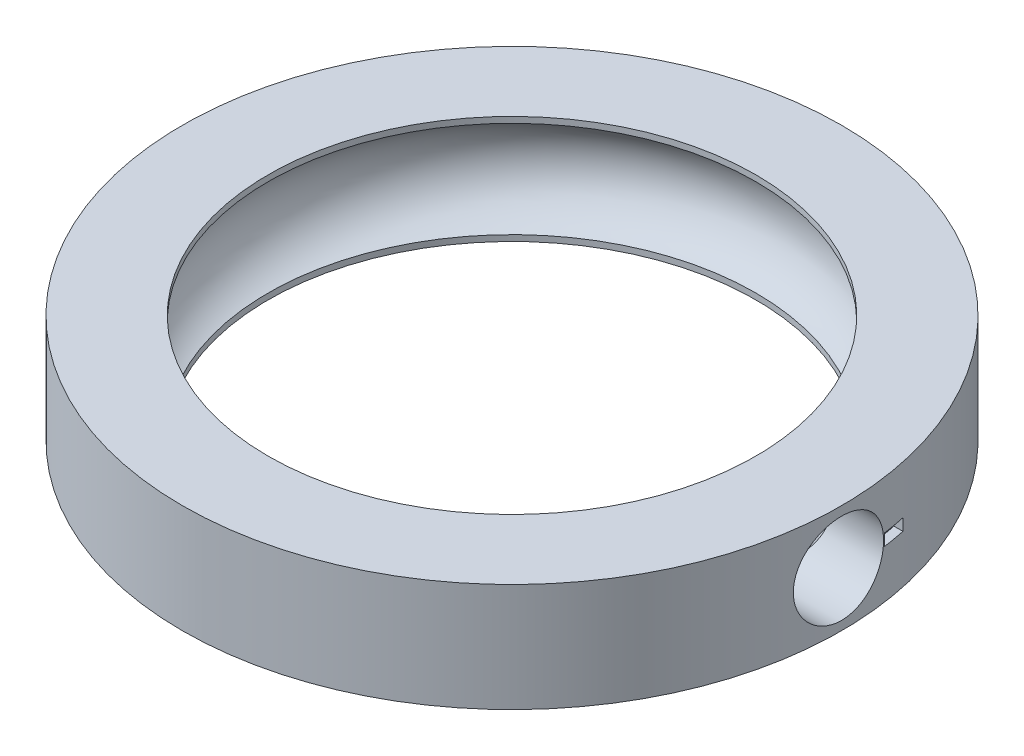
ISO-10303-21;
HEADER;
FILE_DESCRIPTION(('STEP AP214'),'2;1');
FILE_NAME('part.step','',(''),(''),'','','');
FILE_SCHEMA(('AUTOMOTIVE_DESIGN { 1 0 10303 214 1 1 1 1 }'));
ENDSEC;
DATA;
#1=APPLICATION_CONTEXT('core data for automotive mechanical design processes');
#2=APPLICATION_PROTOCOL_DEFINITION('international standard','automotive_design',2000,#1);
#3=PRODUCT_CONTEXT('',#1,'mechanical');
#4=PRODUCT('Part','Part','',(#3));
#5=PRODUCT_RELATED_PRODUCT_CATEGORY('part','',(#4));
#6=PRODUCT_DEFINITION_FORMATION('','',#4);
#7=PRODUCT_DEFINITION_CONTEXT('part definition',#1,'design');
#8=PRODUCT_DEFINITION('design','',#6,#7);
#9=PRODUCT_DEFINITION_SHAPE('','',#8);
#10=(LENGTH_UNIT() NAMED_UNIT(*) SI_UNIT(.MILLI.,.METRE.));
#11=(NAMED_UNIT(*) PLANE_ANGLE_UNIT() SI_UNIT($,.RADIAN.));
#12=(NAMED_UNIT(*) SI_UNIT($,.STERADIAN.) SOLID_ANGLE_UNIT());
#13=UNCERTAINTY_MEASURE_WITH_UNIT(LENGTH_MEASURE(1.E-05),#10,'distance_accuracy_value','');
#14=(GEOMETRIC_REPRESENTATION_CONTEXT(3) GLOBAL_UNCERTAINTY_ASSIGNED_CONTEXT((#13)) GLOBAL_UNIT_ASSIGNED_CONTEXT((#10,
#11,#12)) REPRESENTATION_CONTEXT('',''));
#15=CARTESIAN_POINT('',(0.,0.,0.));
#16=DIRECTION('',(0.,0.,1.));
#17=DIRECTION('',(1.,0.,0.));
#18=AXIS2_PLACEMENT_3D('',#15,#16,#17);
#19=CARTESIAN_POINT('',(0.,6.,0.));
#20=DIRECTION('',(0.,-1.,0.));
#21=DIRECTION('',(0.,0.,-1.));
#22=AXIS2_PLACEMENT_3D('',#19,#20,#21);
#23=CYLINDRICAL_SURFACE('',#22,18.25);
#24=CARTESIAN_POINT('',(18.25,0.499999999999999,0.));
#25=CARTESIAN_POINT('',(18.2499979040116,0.500005861245504,-0.139724369501618));
#26=CARTESIAN_POINT('',(18.2483784906353,0.511753259206182,-0.279533206564035));
#27=CARTESIAN_POINT('',(18.2420741366363,0.558425963353944,-0.555252491505958));
#28=CARTESIAN_POINT('',(18.2373860938597,0.593374724887227,-0.69115884898439));
#29=CARTESIAN_POINT('',(18.2254720195933,0.685394310822123,-0.95504229326292));
#30=CARTESIAN_POINT('',(18.2182477932557,0.742449403824003,-1.08302494381824));
#31=CARTESIAN_POINT('',(18.202062445911,0.877025750622886,-1.32757707156655));
#32=CARTESIAN_POINT('',(18.1931015968321,0.954543800926233,-1.44414833131024));
#33=CARTESIAN_POINT('',(18.1743758918273,1.12838855913507,-1.66335577304885));
#34=CARTESIAN_POINT('',(18.164606629599,1.22482288873818,-1.76590623699541));
#35=CARTESIAN_POINT('',(18.1454002015019,1.43353140071663,-1.95342218965998));
#36=CARTESIAN_POINT('',(18.1359630535417,1.54580643563522,-2.03838673129997));
#37=CARTESIAN_POINT('',(18.1184463556851,1.78357534865549,-2.18864516568642));
#38=CARTESIAN_POINT('',(18.1103724937461,1.90912122087476,-2.25385750333834));
#39=CARTESIAN_POINT('',(18.0965557008651,2.16951226928633,-2.36223941235566));
#40=CARTESIAN_POINT('',(18.090812664016,2.30435702263428,-2.40540998526832));
#41=CARTESIAN_POINT('',(18.0823505059671,2.57862256729802,-2.46821968742486));
#42=CARTESIAN_POINT('',(18.079612665332,2.71800939700837,-2.48800454685787));
#43=CARTESIAN_POINT('',(18.0774138405005,2.99814962997799,-2.50393238205174));
#44=CARTESIAN_POINT('',(18.0779526988637,3.13890296725423,-2.50007649371428));
#45=CARTESIAN_POINT('',(18.082229259379,3.41675883712277,-2.46895166738218));
#46=CARTESIAN_POINT('',(18.085944918217,3.55387982999411,-2.4418440651346));
#47=CARTESIAN_POINT('',(18.096122018592,3.82160837034374,-2.36523739982944));
#48=CARTESIAN_POINT('',(18.1025835259105,3.95221576169377,-2.3157378003313));
#49=CARTESIAN_POINT('',(18.1175489811576,4.20370611281216,-2.19558141778014));
#50=CARTESIAN_POINT('',(18.1260596004328,4.324555550862,-2.12485533779655));
#51=CARTESIAN_POINT('',(18.1441593559929,4.55273191042993,-1.96430311662161));
#52=CARTESIAN_POINT('',(18.1537485514315,4.66005808959088,-1.87447592760474));
#53=CARTESIAN_POINT('',(18.1730227308133,4.85907714911466,-1.67738112139687));
#54=CARTESIAN_POINT('',(18.1827078478558,4.95063251087264,-1.56997459942147));
#55=CARTESIAN_POINT('',(18.2010082125304,5.11443751989617,-1.34124604576295));
#56=CARTESIAN_POINT('',(18.2096234567742,5.18668710602171,-1.21992397001201));
#57=CARTESIAN_POINT('',(18.2248203085879,5.30983293817849,-0.966696137526372));
#58=CARTESIAN_POINT('',(18.2314010087724,5.3607196602059,-0.834785691429525));
#59=CARTESIAN_POINT('',(18.2417794124589,5.43958137570936,-0.564181772410236));
#60=CARTESIAN_POINT('',(18.2455772726284,5.46755765900203,-0.425488681804442));
#61=CARTESIAN_POINT('',(18.2499415443552,5.49962400471943,-0.146444513006579));
#62=CARTESIAN_POINT('',(18.2505335596003,5.50390333066426,-0.00611556915733932));
#63=CARTESIAN_POINT('',(18.2484888260768,5.48895508012057,0.273257647269836));
#64=CARTESIAN_POINT('',(18.2458521602546,5.46972810752048,0.412301952758304));
#65=CARTESIAN_POINT('',(18.2376622007997,5.40847035443507,0.684593694797279));
#66=CARTESIAN_POINT('',(18.2321205673131,5.36653071739046,0.817862016654266));
#67=CARTESIAN_POINT('',(18.2187405521202,5.26113352531695,1.07547462983269));
#68=CARTESIAN_POINT('',(18.2109020784471,5.19767510864762,1.1998185635682));
#69=CARTESIAN_POINT('',(18.1937371565602,5.05059016038336,1.43689206404122));
#70=CARTESIAN_POINT('',(18.184401874396,4.96684228234124,1.54954569416385));
#71=CARTESIAN_POINT('',(18.1653129124748,4.78172612117652,1.75926601464015));
#72=CARTESIAN_POINT('',(18.1555592126372,4.68035699165745,1.85633195584381));
#73=CARTESIAN_POINT('',(18.1366527064345,4.46203798783335,2.03280094185795));
#74=CARTESIAN_POINT('',(18.1275044959868,4.34498571461474,2.11207786919162));
#75=CARTESIAN_POINT('',(18.1109230526373,4.09911558779693,2.24984473713914));
#76=CARTESIAN_POINT('',(18.1034897796954,3.97029800898892,2.30833516308778));
#77=CARTESIAN_POINT('',(18.0912121062168,3.70494671325027,2.40266847878071));
#78=CARTESIAN_POINT('',(18.0863598328567,3.56843788237555,2.43858030175146));
#79=CARTESIAN_POINT('',(18.0797717497483,3.29125602132422,2.48695788125156));
#80=CARTESIAN_POINT('',(18.078035763259,3.1505832277678,2.49942496745691));
#81=CARTESIAN_POINT('',(18.0778826418353,2.87032231083625,2.50053146396423));
#82=CARTESIAN_POINT('',(18.0794379011307,2.73073494406066,2.48936906948717));
#83=CARTESIAN_POINT('',(18.0856323892646,2.45544131919566,2.44395546124434));
#84=CARTESIAN_POINT('',(18.0902716162146,2.3197350587296,2.40970426161765));
#85=CARTESIAN_POINT('',(18.1021022675613,2.05609520579024,2.31915106224086));
#86=CARTESIAN_POINT('',(18.1092923566615,1.92815758763409,2.2628605977623));
#87=CARTESIAN_POINT('',(18.1254165093313,1.68351107513241,2.1298462469603));
#88=CARTESIAN_POINT('',(18.1343506119436,1.56680243225368,2.05312190317618));
#89=CARTESIAN_POINT('',(18.1530456998378,1.34691627863378,1.88068910588684));
#90=CARTESIAN_POINT('',(18.162812743567,1.2438548279686,1.78483329597902));
#91=CARTESIAN_POINT('',(18.1820210316241,1.0552071616275,1.57716876279148));
#92=CARTESIAN_POINT('',(18.1914621991514,0.969625042329904,1.46535631038966));
#93=CARTESIAN_POINT('',(18.2090034175131,0.818024380284724,1.22835916797422));
#94=CARTESIAN_POINT('',(18.2170971535198,0.752096870052508,1.10311579940462));
#95=CARTESIAN_POINT('',(18.2309687741467,0.642307643754578,0.843288650999033));
#96=CARTESIAN_POINT('',(18.2367491202142,0.598422461896822,0.708714978500943));
#97=CARTESIAN_POINT('',(18.2439828522169,0.544219052785864,0.477904922893143));
#98=CARTESIAN_POINT('',(18.2462280198345,0.527661421171916,0.383110759332425));
#99=CARTESIAN_POINT('',(18.2492373077064,0.505549930876812,0.192224383507808));
#100=CARTESIAN_POINT('',(18.2500014420673,0.499995967386855,0.0961321836163472));
#101=CARTESIAN_POINT('',(18.25,0.499999999999999,0.));
#102=B_SPLINE_CURVE_WITH_KNOTS('',3,(#24,#25,#26,#27,#28,#29,#30,#31,#32,#33,#34,#35,#36,#37,
#38,#39,#40,#41,#42,#43,#44,#45,#46,#47,#48,#49,#50,#51,#52,#53,#54,#55,#56,#57,#58,#59,#60,#61,
#62,#63,#64,#65,#66,#67,#68,#69,#70,#71,#72,#73,#74,#75,#76,#77,#78,#79,#80,#81,#82,#83,#84,#85,
#86,#87,#88,#89,#90,#91,#92,#93,#94,#95,#96,#97,#98,#99,#100,#101),.UNSPECIFIED.,.T.,.F.,(4,2,2,
2,2,2,2,2,2,2,2,2,2,2,2,2,2,2,2,2,2,2,2,2,2,2,2,2,2,2,2,2,2,2,2,2,2,2,4),(0.,0.418821906804338,
0.838067866394558,1.25701602676968,1.67589863930418,2.09723742276973,2.51859889125171,
2.94167712445848,3.36473613186521,3.78514467184421,4.20553301199569,4.62302780037517,
5.04053259112257,5.45941549393193,5.87832138124315,6.30071305090791,6.72310605824093,
7.14568717759145,7.56824450474701,7.98742201806005,8.40658876272202,8.82408576810228,
9.24159949259022,9.66167473966672,10.081770169674,10.5047559046988,10.9277317629689,
11.3494099097899,11.7710641402738,12.1891957126847,12.6073270290413,13.0252397889091,
13.4431619055285,13.8644366704996,14.2858100505503,14.7091057847878,15.1319499272034,
15.4201075913995,15.7082625109105),.UNSPECIFIED.);
#103=CARTESIAN_POINT('',(18.25,0.499999999999999,0.));
#104=VERTEX_POINT('',#103);
#105=EDGE_CURVE('E113',#104,#104,#102,.T.);
#106=ORIENTED_EDGE('',*,*,#105,.F.);
#107=EDGE_LOOP('',(#106));
#108=FACE_BOUND('',#107,.T.);
#109=CARTESIAN_POINT('',(0.,0.,0.));
#110=DIRECTION('',(0.,1.,0.));
#111=DIRECTION('',(0.,0.,1.));
#112=AXIS2_PLACEMENT_3D('',#109,#110,#111);
#113=CIRCLE('',#112,18.25);
#114=CARTESIAN_POINT('',(0.,0.,18.25));
#115=VERTEX_POINT('',#114);
#116=EDGE_CURVE('E56',#115,#115,#113,.T.);
#117=ORIENTED_EDGE('',*,*,#116,.T.);
#118=EDGE_LOOP('',(#117));
#119=FACE_BOUND('',#118,.T.);
#120=CARTESIAN_POINT('',(0.,6.,0.));
#121=DIRECTION('',(0.,1.,0.));
#122=DIRECTION('',(0.,0.,1.));
#123=AXIS2_PLACEMENT_3D('',#120,#121,#122);
#124=CIRCLE('',#123,18.25);
#125=CARTESIAN_POINT('',(0.,6.,18.25));
#126=VERTEX_POINT('',#125);
#127=EDGE_CURVE('E12',#126,#126,#124,.T.);
#128=ORIENTED_EDGE('',*,*,#127,.F.);
#129=EDGE_LOOP('',(#128));
#130=FACE_BOUND('',#129,.T.);
#131=DIRECTION('',(0.,-1.,0.));
#132=VECTOR('',#131,1.);
#133=CARTESIAN_POINT('',(18.0700421424706,6.,-2.55657524226003));
#134=LINE('',#133,#132);
#135=CARTESIAN_POINT('',(18.0700421424706,3.32583707335798,-2.55657524226003));
#136=VERTEX_POINT('',#135);
#137=CARTESIAN_POINT('',(18.0700421424706,2.67416292664202,-2.55657524226003));
#138=VERTEX_POINT('',#137);
#139=EDGE_CURVE('E103',#136,#138,#134,.T.);
#140=ORIENTED_EDGE('',*,*,#139,.F.);
#141=CARTESIAN_POINT('',(0.,3.32583707335798,0.));
#142=DIRECTION('',(0.,-1.,0.));
#143=DIRECTION('',(0.,0.,-1.));
#144=AXIS2_PLACEMENT_3D('',#141,#142,#143);
#145=CIRCLE('',#144,18.25);
#146=CARTESIAN_POINT('',(17.850655436183,3.32583707335798,-3.79691986993031));
#147=VERTEX_POINT('',#146);
#148=EDGE_CURVE('E118',#147,#136,#145,.T.);
#149=ORIENTED_EDGE('',*,*,#148,.F.);
#150=DIRECTION('',(0.,-1.,0.));
#151=VECTOR('',#150,1.);
#152=CARTESIAN_POINT('',(17.850655436183,6.,-3.79691986993031));
#153=LINE('',#152,#151);
#154=CARTESIAN_POINT('',(17.850655436183,2.67416292664202,-3.79691986993031));
#155=VERTEX_POINT('',#154);
#156=EDGE_CURVE('E109',#147,#155,#153,.T.);
#157=ORIENTED_EDGE('',*,*,#156,.T.);
#158=CARTESIAN_POINT('',(0.,2.67416292664202,0.));
#159=DIRECTION('',(0.,1.,0.));
#160=DIRECTION('',(0.,0.,1.));
#161=AXIS2_PLACEMENT_3D('',#158,#159,#160);
#162=CIRCLE('',#161,18.25);
#163=EDGE_CURVE('E66',#138,#155,#162,.T.);
#164=ORIENTED_EDGE('',*,*,#163,.F.);
#165=EDGE_LOOP('',(#140,#149,#157,#164));
#166=FACE_BOUND('',#165,.T.);
#167=ADVANCED_FACE('F44',(#108,#119,#130,#166),#23,.T.);
#168=CARTESIAN_POINT('',(0.,3.,0.));
#169=DIRECTION('',(0.,-1.,0.));
#170=DIRECTION('',(0.,0.,-1.));
#171=AXIS2_PLACEMENT_3D('',#168,#169,#170);
#172=TOROIDAL_SURFACE('',#171,12.5,2.85);
#173=CARTESIAN_POINT('',(0.,5.6688012290165,0.));
#174=DIRECTION('',(0.,-1.,0.));
#175=DIRECTION('',(0.,0.,-1.));
#176=AXIS2_PLACEMENT_3D('',#173,#174,#175);
#177=CIRCLE('',#176,13.5);
#178=CARTESIAN_POINT('',(0.,5.6688012290165,-13.5));
#179=VERTEX_POINT('',#178);
#180=EDGE_CURVE('E137',#179,#179,#177,.T.);
#181=ORIENTED_EDGE('',*,*,#180,.F.);
#182=EDGE_LOOP('',(#181));
#183=FACE_BOUND('',#182,.T.);
#184=CARTESIAN_POINT('',(0.,0.331198770983497,0.));
#185=DIRECTION('',(0.,1.,0.));
#186=DIRECTION('',(0.,0.,1.));
#187=AXIS2_PLACEMENT_3D('',#184,#185,#186);
#188=CIRCLE('',#187,13.5);
#189=CARTESIAN_POINT('',(0.,0.331198770983497,13.5));
#190=VERTEX_POINT('',#189);
#191=EDGE_CURVE('E184',#190,#190,#188,.T.);
#192=ORIENTED_EDGE('',*,*,#191,.F.);
#193=EDGE_LOOP('',(#192));
#194=FACE_BOUND('',#193,.T.);
#195=CARTESIAN_POINT('',(13.8715441921548,0.501916911961674,0.097881996592364));
#196=CARTESIAN_POINT('',(13.8663915308518,0.498776650919,0.0177445681449152));
#197=CARTESIAN_POINT('',(13.8676320913383,0.499516185368776,-0.0629743060014105));
#198=CARTESIAN_POINT('',(13.8825726398326,0.508663281459589,-0.222906565350005));
#199=CARTESIAN_POINT('',(13.8963020513549,0.517088951635276,-0.302115944061143));
#200=CARTESIAN_POINT('',(13.9402187249402,0.545197037600044,-0.485160815534903));
#201=CARTESIAN_POINT('',(13.9745728326146,0.567856801228564,-0.587489336750705));
#202=CARTESIAN_POINT('',(14.0535107318023,0.624214266762777,-0.785033852891165));
#203=CARTESIAN_POINT('',(14.0981353387186,0.657956244661693,-0.880219404594211));
#204=CARTESIAN_POINT('',(14.1820981982862,0.72718277708255,-1.04423413466535));
#205=CARTESIAN_POINT('',(14.2205338333604,0.760760583404032,-1.11435456782482));
#206=CARTESIAN_POINT('',(14.2986692547118,0.833947644543202,-1.25068336291063));
#207=CARTESIAN_POINT('',(14.3383696708257,0.873559942760801,-1.31688972731971));
#208=CARTESIAN_POINT('',(14.4176924486827,0.958686104763215,-1.44532442198896));
#209=CARTESIAN_POINT('',(14.4573148487342,1.0041939020043,-1.50755674464633));
#210=CARTESIAN_POINT('',(14.5355248970745,1.10111369318583,-1.62794498138275));
#211=CARTESIAN_POINT('',(14.5741123486565,1.15252679984289,-1.68610012387773));
#212=CARTESIAN_POINT('',(14.6755309861207,1.29900315622038,-1.83686579677102));
#213=CARTESIAN_POINT('',(14.736614914957,1.39960920166678,-1.92539879449867));
#214=CARTESIAN_POINT('',(14.8494547437103,1.61703332009629,-2.08702918603147));
#215=CARTESIAN_POINT('',(14.9012242015268,1.73382738424936,-2.16014904186124));
#216=CARTESIAN_POINT('',(14.9847039373823,1.96201924617235,-2.27734740717592));
#217=CARTESIAN_POINT('',(15.0182979667852,2.07129434853381,-2.32419998655498));
#218=CARTESIAN_POINT('',(15.0745149235503,2.29796609481341,-2.40239376785153));
#219=CARTESIAN_POINT('',(15.0971424495017,2.41535931092056,-2.43374147154958));
#220=CARTESIAN_POINT('',(15.1299925576085,2.6556932554136,-2.47920640729447));
#221=CARTESIAN_POINT('',(15.1401623045952,2.7786553338617,-2.4932502527358));
#222=CARTESIAN_POINT('',(15.1471622129729,3.0256748112818,-2.50291961152873));
#223=CARTESIAN_POINT('',(15.1439953327797,3.14973196124564,-2.49854920964618));
#224=CARTESIAN_POINT('',(15.1252917034424,3.38578886882881,-2.47269768467517));
#225=CARTESIAN_POINT('',(15.1106768992665,3.49800673644903,-2.45249179476216));
#226=CARTESIAN_POINT('',(15.07111757203,3.71693325100114,-2.39765468026238));
#227=CARTESIAN_POINT('',(15.0461712511731,3.82364093546485,-2.36302094506741));
#228=CARTESIAN_POINT('',(14.9860579150012,4.03372946393335,-2.27919817448103));
#229=CARTESIAN_POINT('',(14.950499098187,4.1367723653864,-2.22944953908681));
#230=CARTESIAN_POINT('',(14.8714889357878,4.33283828727624,-2.11808116599179));
#231=CARTESIAN_POINT('',(14.8280370289536,4.42586059443489,-2.05646058410075));
#232=CARTESIAN_POINT('',(14.7282024293828,4.61423379744427,-1.91318692180701));
#233=CARTESIAN_POINT('',(14.6708578083435,4.7078360740892,-1.82991513562223));
#234=CARTESIAN_POINT('',(14.5512425541929,4.88041237000419,-1.65210629995942));
#235=CARTESIAN_POINT('',(14.4889612136936,4.95935327846146,-1.55754452543505));
#236=CARTESIAN_POINT('',(14.3882881381688,5.07376567382807,-1.39818521836404));
#237=CARTESIAN_POINT('',(14.3502595412475,5.11402922026255,-1.33653037934707));
#238=CARTESIAN_POINT('',(14.2747473360895,5.18913283524563,-1.20960322446512));
#239=CARTESIAN_POINT('',(14.237264040091,5.22396989947069,-1.14432893164597));
#240=CARTESIAN_POINT('',(14.1642417084047,5.28800757555597,-1.01021493625716));
#241=CARTESIAN_POINT('',(14.128698975711,5.31721919362645,-0.941382537007137));
#242=CARTESIAN_POINT('',(14.0613189366418,5.36979868164556,-0.799842159530013));
#243=CARTESIAN_POINT('',(14.0294773997651,5.39317325920287,-0.727138747359342));
#244=CARTESIAN_POINT('',(13.9717863088816,5.43376244307067,-0.576967075635674));
#245=CARTESIAN_POINT('',(13.9459839925343,5.45092902491868,-0.499466882078776));
#246=CARTESIAN_POINT('',(13.9042129077133,5.47796324438452,-0.340783806857063));
#247=CARTESIAN_POINT('',(13.888209143095,5.48785688349082,-0.259615156407121));
#248=CARTESIAN_POINT('',(13.8690943644233,5.49961146196823,-0.0941639989199542));
#249=CARTESIAN_POINT('',(13.8661271448818,5.50138282096576,-0.00985705707718012));
#250=CARTESIAN_POINT('',(13.8742640431083,5.49642586944656,0.157871762902022));
#251=CARTESIAN_POINT('',(13.8853876602214,5.48968578055943,0.241292253120113));
#252=CARTESIAN_POINT('',(13.9228116745893,5.46606696438205,0.422678652078051));
#253=CARTESIAN_POINT('',(13.9519258956407,5.44727466651692,0.519778124883477));
#254=CARTESIAN_POINT('',(14.0206254184853,5.39970009389325,0.707754415495412));
#255=CARTESIAN_POINT('',(14.060252103058,5.37087819422935,0.798604813506495));
#256=CARTESIAN_POINT('',(14.1372075119341,5.31033222740344,0.958257593118432));
#257=CARTESIAN_POINT('',(14.1736487289493,5.28008347160127,1.02806960101252));
#258=CARTESIAN_POINT('',(14.2483505722067,5.21381826878189,1.16392655721612));
#259=CARTESIAN_POINT('',(14.2866121823082,5.17779867735125,1.22996942503615));
#260=CARTESIAN_POINT('',(14.3636016693271,5.10010986496694,1.35836952164236));
#261=CARTESIAN_POINT('',(14.4023296295569,5.05843962047052,1.42072607975596));
#262=CARTESIAN_POINT('',(14.4792478501477,4.96946565108275,1.54170183074615));
#263=CARTESIAN_POINT('',(14.5174378342794,4.92215914221342,1.60031915453308));
#264=CARTESIAN_POINT('',(14.5933234904638,4.82072965179368,1.71491639734867));
#265=CARTESIAN_POINT('',(14.6309846932977,4.76646914362321,1.7707978324886));
#266=CARTESIAN_POINT('',(14.7040148751839,4.65213842200734,1.87791732673344));
#267=CARTESIAN_POINT('',(14.7393842621372,4.59206924716748,1.92915621277696));
#268=CARTESIAN_POINT('',(14.8070044432304,4.46637414495278,2.02633668470843));
#269=CARTESIAN_POINT('',(14.8392615691679,4.40076003188509,2.07228906412993));
#270=CARTESIAN_POINT('',(14.8999825849772,4.26419350988315,2.15831640281818));
#271=CARTESIAN_POINT('',(14.9284482279447,4.19324359201474,2.19839407928218));
#272=CARTESIAN_POINT('',(14.9918772033774,4.01561763738465,2.28737206091154));
#273=CARTESIAN_POINT('',(15.0245773595391,3.90641234738633,2.33294973237999));
#274=CARTESIAN_POINT('',(15.0790153202557,3.68021203604189,2.40863471571787));
#275=CARTESIAN_POINT('',(15.1007599110958,3.56322188790195,2.43875160479084));
#276=CARTESIAN_POINT('',(15.1319465383071,3.32397776014425,2.48190657473171));
#277=CARTESIAN_POINT('',(15.1413376677114,3.20170413060752,2.49487398605983));
#278=CARTESIAN_POINT('',(15.1469522391934,2.95628307118886,2.50262939524515));
#279=CARTESIAN_POINT('',(15.1431777390313,2.83313578086072,2.49742023406224));
#280=CARTESIAN_POINT('',(15.1234486100258,2.5982515854202,2.47014910182853));
#281=CARTESIAN_POINT('',(15.1083318413911,2.48630495607694,2.44924635992355));
#282=CARTESIAN_POINT('',(15.0678369093715,2.26803338280327,2.39310090445858));
#283=CARTESIAN_POINT('',(15.0424567783201,2.16170952127853,2.35785544113903));
#284=CARTESIAN_POINT('',(14.9814482860983,1.95216024408673,2.27275350309862));
#285=CARTESIAN_POINT('',(14.9454029045608,1.84930120997193,2.22230049806616));
#286=CARTESIAN_POINT('',(14.8654726239244,1.6537061031357,2.10956140304857));
#287=CARTESIAN_POINT('',(14.8215872188185,1.56097068443054,2.04727454927239));
#288=CARTESIAN_POINT('',(14.7208057873903,1.37313059213152,1.90247835019392));
#289=CARTESIAN_POINT('',(14.6629461076414,1.27981086593324,1.81833413690515));
#290=CARTESIAN_POINT('',(14.5424110605782,1.10792583922641,1.63876783863594));
#291=CARTESIAN_POINT('',(14.479725132989,1.02939426821317,1.5433207616134));
#292=CARTESIAN_POINT('',(14.3785682498127,0.915743659270463,1.38251251971237));
#293=CARTESIAN_POINT('',(14.3403973668264,0.87579204798954,1.3203105278055));
#294=CARTESIAN_POINT('',(14.2647055199327,0.801361095847264,1.19225689679117));
#295=CARTESIAN_POINT('',(14.2271849283975,0.766884803681293,1.12640325175713));
#296=CARTESIAN_POINT('',(14.1542264860585,0.703612882691235,0.991050124033389));
#297=CARTESIAN_POINT('',(14.1187855512301,0.674808684903256,0.92155634482912));
#298=CARTESIAN_POINT('',(14.0518565557115,0.623133201151694,0.7786346739731));
#299=CARTESIAN_POINT('',(14.0203640917808,0.600255275432847,0.70521129732533));
#300=CARTESIAN_POINT('',(13.9607057894353,0.55868030184224,0.545458298142968));
#301=CARTESIAN_POINT('',(13.9333315282207,0.540759937099515,0.458612697856814));
#302=CARTESIAN_POINT('',(13.891737226086,0.514201771485612,0.280709376009896));
#303=CARTESIAN_POINT('',(13.8774464193603,0.505513991813856,0.189677145262063));
#304=CARTESIAN_POINT('',(13.8715441921548,0.501916911961674,0.097881996592364));
#305=B_SPLINE_CURVE_WITH_KNOTS('',3,(#195,#196,#197,#198,#199,#200,#201,#202,#203,#204,#205,
#206,#207,#208,#209,#210,#211,#212,#213,#214,#215,#216,#217,#218,#219,#220,#221,#222,#223,#224,
#225,#226,#227,#228,#229,#230,#231,#232,#233,#234,#235,#236,#237,#238,#239,#240,#241,#242,#243,
#244,#245,#246,#247,#248,#249,#250,#251,#252,#253,#254,#255,#256,#257,#258,#259,#260,#261,#262,
#263,#264,#265,#266,#267,#268,#269,#270,#271,#272,#273,#274,#275,#276,#277,#278,#279,#280,#281,
#282,#283,#284,#285,#286,#287,#288,#289,#290,#291,#292,#293,#294,#295,#296,#297,#298,#299,#300,
#301,#302,#303,#304),.UNSPECIFIED.,.T.,.F.,(4,2,2,2,2,2,2,2,2,2,2,2,2,2,2,2,2,2,2,2,2,2,2,2,2,2,
2,2,2,2,2,2,2,2,2,2,2,2,2,2,2,2,2,2,2,2,2,2,2,2,2,2,2,2,4),(0.,0.240764020655616,
0.482096750439963,0.811098618730252,1.14143124782403,1.40130594249321,1.66131213740192,
1.92105287677258,2.18084263871184,2.62081391119508,3.06013949868034,3.42922563360741,
3.7981568652679,4.16864742787232,4.53905581022325,4.88236468260761,5.22573331958738,
5.58380040399027,5.94189295922687,6.35376802812118,6.76656224428157,7.01497461343351,
7.26352402876688,7.51158210233349,7.75935379556933,8.00900317458032,8.25775563308081,
8.50924507855035,8.76108292355226,9.06865167135236,9.37744962120188,9.6302213164073,
9.88313121324538,10.1360869827885,10.3891682194449,10.6483892698806,10.9075640562827,
11.1661999207684,11.4247157796457,11.7913746005903,12.157806019309,12.5257427711436,
12.8936220178171,13.2367127877881,13.5798693654882,13.9387810651033,14.2977159377988,
14.7112438582311,15.1257038408234,15.3750808797036,15.624596290257,15.8737318104556,
16.1225869816652,16.3998841929108,16.6756725417332),.UNSPECIFIED.);
#306=CARTESIAN_POINT('',(13.8715441921548,0.501916911961674,0.097881996592364));
#307=VERTEX_POINT('',#306);
#308=EDGE_CURVE('E47',#307,#307,#305,.T.);
#309=ORIENTED_EDGE('',*,*,#308,.T.);
#310=EDGE_LOOP('',(#309));
#311=FACE_BOUND('',#310,.T.);
#312=ADVANCED_FACE('F149',(#183,#194,#311),#172,.F.);
#313=CARTESIAN_POINT('',(0.,6.,0.));
#314=DIRECTION('',(0.,-1.,0.));
#315=DIRECTION('',(0.,0.,-1.));
#316=AXIS2_PLACEMENT_3D('',#313,#314,#315);
#317=CYLINDRICAL_SURFACE('',#316,13.5);
#318=CARTESIAN_POINT('',(0.,0.,0.));
#319=DIRECTION('',(0.,1.,0.));
#320=DIRECTION('',(0.,0.,1.));
#321=AXIS2_PLACEMENT_3D('',#318,#319,#320);
#322=CIRCLE('',#321,13.5);
#323=CARTESIAN_POINT('',(0.,0.,13.5));
#324=VERTEX_POINT('',#323);
#325=EDGE_CURVE('E185',#324,#324,#322,.T.);
#326=ORIENTED_EDGE('',*,*,#325,.F.);
#327=EDGE_LOOP('',(#326));
#328=FACE_BOUND('',#327,.T.);
#329=ORIENTED_EDGE('',*,*,#191,.T.);
#330=EDGE_LOOP('',(#329));
#331=FACE_BOUND('',#330,.T.);
#332=ADVANCED_FACE('F155',(#328,#331),#317,.F.);
#333=CARTESIAN_POINT('',(0.,6.,0.));
#334=DIRECTION('',(0.,1.,0.));
#335=DIRECTION('',(0.,0.,1.));
#336=AXIS2_PLACEMENT_3D('',#333,#334,#335);
#337=CIRCLE('',#336,13.5);
#338=CARTESIAN_POINT('',(0.,6.,13.5));
#339=VERTEX_POINT('',#338);
#340=EDGE_CURVE('E140',#339,#339,#337,.T.);
#341=ORIENTED_EDGE('',*,*,#340,.T.);
#342=EDGE_LOOP('',(#341));
#343=FACE_BOUND('',#342,.T.);
#344=ORIENTED_EDGE('',*,*,#180,.T.);
#345=EDGE_LOOP('',(#344));
#346=FACE_BOUND('',#345,.T.);
#347=ADVANCED_FACE('F160',(#343,#346),#317,.F.);
#348=CARTESIAN_POINT('',(0.,6.,0.));
#349=DIRECTION('',(0.,1.,0.));
#350=DIRECTION('',(0.,0.,1.));
#351=AXIS2_PLACEMENT_3D('',#348,#349,#350);
#352=PLANE('',#351);
#353=ORIENTED_EDGE('',*,*,#127,.T.);
#354=EDGE_LOOP('',(#353));
#355=FACE_BOUND('',#354,.T.);
#356=ORIENTED_EDGE('',*,*,#340,.F.);
#357=EDGE_LOOP('',(#356));
#358=FACE_BOUND('',#357,.T.);
#359=ADVANCED_FACE('F159',(#355,#358),#352,.T.);
#360=CARTESIAN_POINT('',(0.,0.,0.));
#361=DIRECTION('',(0.,1.,0.));
#362=DIRECTION('',(0.,0.,1.));
#363=AXIS2_PLACEMENT_3D('',#360,#361,#362);
#364=PLANE('',#363);
#365=ORIENTED_EDGE('',*,*,#116,.F.);
#366=EDGE_LOOP('',(#365));
#367=FACE_BOUND('',#366,.T.);
#368=ORIENTED_EDGE('',*,*,#325,.T.);
#369=EDGE_LOOP('',(#368));
#370=FACE_BOUND('',#369,.T.);
#371=ADVANCED_FACE('F144',(#367,#370),#364,.F.);
#372=CARTESIAN_POINT('',(18.25,3.,0.));
#373=DIRECTION('',(-1.,0.,0.));
#374=DIRECTION('',(0.,0.,1.));
#375=AXIS2_PLACEMENT_3D('',#372,#373,#374);
#376=CYLINDRICAL_SURFACE('',#375,2.5);
#377=ORIENTED_EDGE('',*,*,#308,.F.);
#378=EDGE_LOOP('',(#377));
#379=FACE_BOUND('',#378,.T.);
#380=ORIENTED_EDGE('',*,*,#105,.T.);
#381=EDGE_LOOP('',(#380));
#382=FACE_BOUND('',#381,.T.);
#383=ADVANCED_FACE('F139',(#379,#382),#376,.F.);
#384=CARTESIAN_POINT('',(-0.5,6.,0.));
#385=DIRECTION('',(0.,-1.,0.));
#386=DIRECTION('',(0.,0.,-1.));
#387=AXIS2_PLACEMENT_3D('',#384,#385,#386);
#388=CYLINDRICAL_SURFACE('',#387,18.25);
#389=DIRECTION('',(0.,-1.,0.));
#390=VECTOR('',#389,1.);
#391=CARTESIAN_POINT('',(17.5700421424706,6.,-2.55657524226003));
#392=LINE('',#391,#390);
#393=CARTESIAN_POINT('',(17.5700421424706,3.32583707335798,-2.55657524226003));
#394=VERTEX_POINT('',#393);
#395=CARTESIAN_POINT('',(17.5700421424706,2.67416292664202,-2.55657524226003));
#396=VERTEX_POINT('',#395);
#397=EDGE_CURVE('E123',#394,#396,#392,.T.);
#398=ORIENTED_EDGE('',*,*,#397,.T.);
#399=CARTESIAN_POINT('',(-0.5,2.67416292664202,0.));
#400=DIRECTION('',(0.,1.,0.));
#401=DIRECTION('',(0.,0.,1.));
#402=AXIS2_PLACEMENT_3D('',#399,#400,#401);
#403=CIRCLE('',#402,18.25);
#404=CARTESIAN_POINT('',(17.350655436183,2.67416292664202,-3.79691986993031));
#405=VERTEX_POINT('',#404);
#406=EDGE_CURVE('E99',#396,#405,#403,.T.);
#407=ORIENTED_EDGE('',*,*,#406,.T.);
#408=DIRECTION('',(0.,-1.,0.));
#409=VECTOR('',#408,1.);
#410=CARTESIAN_POINT('',(17.350655436183,6.,-3.79691986993031));
#411=LINE('',#410,#409);
#412=CARTESIAN_POINT('',(17.350655436183,3.32583707335798,-3.79691986993031));
#413=VERTEX_POINT('',#412);
#414=EDGE_CURVE('E117',#413,#405,#411,.T.);
#415=ORIENTED_EDGE('',*,*,#414,.F.);
#416=CARTESIAN_POINT('',(-0.5,3.32583707335798,0.));
#417=DIRECTION('',(0.,-1.,0.));
#418=DIRECTION('',(0.,0.,-1.));
#419=AXIS2_PLACEMENT_3D('',#416,#417,#418);
#420=CIRCLE('',#419,18.25);
#421=EDGE_CURVE('E91',#413,#394,#420,.T.);
#422=ORIENTED_EDGE('',*,*,#421,.T.);
#423=EDGE_LOOP('',(#398,#407,#415,#422));
#424=FACE_BOUND('',#423,.T.);
#425=ADVANCED_FACE('F141',(#424),#388,.T.);
#426=CARTESIAN_POINT('',(18.0700421424706,6.,-2.55657524226003));
#427=DIRECTION('',(0.,0.,-1.));
#428=DIRECTION('',(-1.,0.,0.));
#429=AXIS2_PLACEMENT_3D('',#426,#427,#428);
#430=PLANE('',#429);
#431=ORIENTED_EDGE('',*,*,#397,.F.);
#432=DIRECTION('',(-1.,0.,0.));
#433=VECTOR('',#432,1.);
#434=CARTESIAN_POINT('',(18.0700421424706,3.32583707335798,-2.55657524226003));
#435=LINE('',#434,#433);
#436=EDGE_CURVE('E77',#136,#394,#435,.T.);
#437=ORIENTED_EDGE('',*,*,#436,.F.);
#438=ORIENTED_EDGE('',*,*,#139,.T.);
#439=DIRECTION('',(-1.,0.,0.));
#440=VECTOR('',#439,1.);
#441=CARTESIAN_POINT('',(18.0700421424706,2.67416292664202,-2.55657524226003));
#442=LINE('',#441,#440);
#443=EDGE_CURVE('E96',#138,#396,#442,.T.);
#444=ORIENTED_EDGE('',*,*,#443,.T.);
#445=EDGE_LOOP('',(#431,#437,#438,#444));
#446=FACE_BOUND('',#445,.T.);
#447=ADVANCED_FACE('F104',(#446),#430,.T.);
#448=CARTESIAN_POINT('',(18.0700421424706,3.32583707335798,-2.55657524226003));
#449=DIRECTION('',(0.,-1.,0.));
#450=DIRECTION('',(0.,0.,-1.));
#451=AXIS2_PLACEMENT_3D('',#448,#449,#450);
#452=PLANE('',#451);
#453=ORIENTED_EDGE('',*,*,#421,.F.);
#454=DIRECTION('',(-1.,0.,0.));
#455=VECTOR('',#454,1.);
#456=CARTESIAN_POINT('',(17.850655436183,3.32583707335798,-3.79691986993031));
#457=LINE('',#456,#455);
#458=EDGE_CURVE('E119',#147,#413,#457,.T.);
#459=ORIENTED_EDGE('',*,*,#458,.F.);
#460=ORIENTED_EDGE('',*,*,#148,.T.);
#461=ORIENTED_EDGE('',*,*,#436,.T.);
#462=EDGE_LOOP('',(#453,#459,#460,#461));
#463=FACE_BOUND('',#462,.T.);
#464=ADVANCED_FACE('F232',(#463),#452,.T.);
#465=CARTESIAN_POINT('',(17.850655436183,2.67416292664202,-3.79691986993031));
#466=DIRECTION('',(0.,1.,0.));
#467=DIRECTION('',(0.,0.,1.));
#468=AXIS2_PLACEMENT_3D('',#465,#466,#467);
#469=PLANE('',#468);
#470=ORIENTED_EDGE('',*,*,#406,.F.);
#471=ORIENTED_EDGE('',*,*,#443,.F.);
#472=ORIENTED_EDGE('',*,*,#163,.T.);
#473=DIRECTION('',(-1.,0.,0.));
#474=VECTOR('',#473,1.);
#475=CARTESIAN_POINT('',(17.850655436183,2.67416292664202,-3.79691986993031));
#476=LINE('',#475,#474);
#477=EDGE_CURVE('E112',#155,#405,#476,.T.);
#478=ORIENTED_EDGE('',*,*,#477,.T.);
#479=EDGE_LOOP('',(#470,#471,#472,#478));
#480=FACE_BOUND('',#479,.T.);
#481=ADVANCED_FACE('F100',(#480),#469,.T.);
#482=CARTESIAN_POINT('',(17.850655436183,6.,-3.79691986993031));
#483=DIRECTION('',(0.,0.,-1.));
#484=DIRECTION('',(-1.,0.,0.));
#485=AXIS2_PLACEMENT_3D('',#482,#483,#484);
#486=PLANE('',#485);
#487=ORIENTED_EDGE('',*,*,#414,.T.);
#488=ORIENTED_EDGE('',*,*,#477,.F.);
#489=ORIENTED_EDGE('',*,*,#156,.F.);
#490=ORIENTED_EDGE('',*,*,#458,.T.);
#491=EDGE_LOOP('',(#487,#488,#489,#490));
#492=FACE_BOUND('',#491,.T.);
#493=ADVANCED_FACE('F147',(#492),#486,.F.);
#494=CLOSED_SHELL('',(#167,#312,#332,#347,#359,#371,#383,#425,#447,#464,#481,#493));
#495=MANIFOLD_SOLID_BREP('B2',#494);
#496=ADVANCED_BREP_SHAPE_REPRESENTATION('',(#18,#495),#14);
#497=SHAPE_DEFINITION_REPRESENTATION(#9,#496);
ENDSEC;
END-ISO-10303-21;
